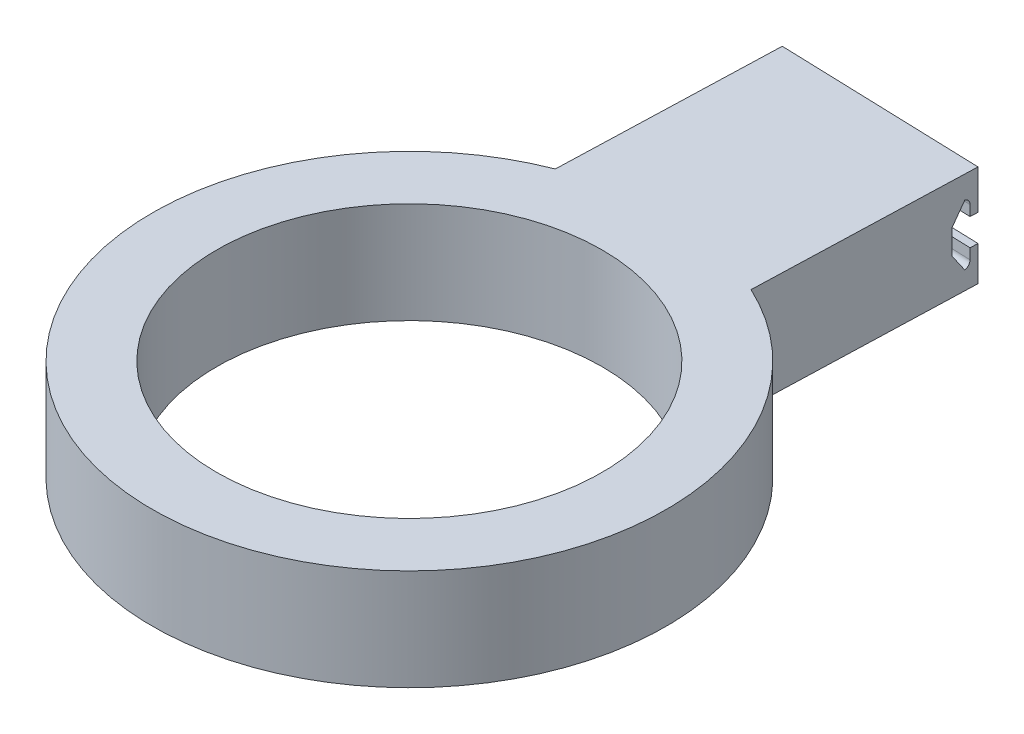
ISO-10303-21;
HEADER;
FILE_DESCRIPTION(('STEP AP214'),'2;1');
FILE_NAME('part.step','',(''),(''),'','','');
FILE_SCHEMA(('AUTOMOTIVE_DESIGN { 1 0 10303 214 1 1 1 1 }'));
ENDSEC;
DATA;
#1=APPLICATION_CONTEXT('core data for automotive mechanical design processes');
#2=APPLICATION_PROTOCOL_DEFINITION('international standard','automotive_design',2000,#1);
#3=PRODUCT_CONTEXT('',#1,'mechanical');
#4=PRODUCT('Part','Part','',(#3));
#5=PRODUCT_RELATED_PRODUCT_CATEGORY('part','',(#4));
#6=PRODUCT_DEFINITION_FORMATION('','',#4);
#7=PRODUCT_DEFINITION_CONTEXT('part definition',#1,'design');
#8=PRODUCT_DEFINITION('design','',#6,#7);
#9=PRODUCT_DEFINITION_SHAPE('','',#8);
#10=(LENGTH_UNIT() NAMED_UNIT(*) SI_UNIT(.MILLI.,.METRE.));
#11=(NAMED_UNIT(*) PLANE_ANGLE_UNIT() SI_UNIT($,.RADIAN.));
#12=(NAMED_UNIT(*) SI_UNIT($,.STERADIAN.) SOLID_ANGLE_UNIT());
#13=UNCERTAINTY_MEASURE_WITH_UNIT(LENGTH_MEASURE(1.E-05),#10,'distance_accuracy_value','');
#14=(GEOMETRIC_REPRESENTATION_CONTEXT(3) GLOBAL_UNCERTAINTY_ASSIGNED_CONTEXT((#13)) GLOBAL_UNIT_ASSIGNED_CONTEXT((#10,
#11,#12)) REPRESENTATION_CONTEXT('',''));
#15=CARTESIAN_POINT('',(0.,0.,0.));
#16=DIRECTION('',(0.,0.,1.));
#17=DIRECTION('',(1.,0.,0.));
#18=AXIS2_PLACEMENT_3D('',#15,#16,#17);
#19=CARTESIAN_POINT('',(2.950089281079,0.,-90.1139316346645));
#20=DIRECTION('',(-0.0327197986339648,0.,0.999464564042844));
#21=DIRECTION('',(0.999464564042844,0.,0.0327197986339648));
#22=AXIS2_PLACEMENT_3D('',#19,#20,#21);
#23=PLANE('',#22);
#24=DIRECTION('',(0.,1.,0.));
#25=VECTOR('',#24,1.);
#26=CARTESIAN_POINT('',(-17.049910718921,0.,-90.7686781821882));
#27=LINE('',#26,#25);
#28=CARTESIAN_POINT('',(-17.049910718921,0.,-90.7686781821882));
#29=VERTEX_POINT('',#28);
#30=CARTESIAN_POINT('',(-17.049910718921,6.88848700330124,-90.7686781821882));
#31=VERTEX_POINT('',#30);
#32=EDGE_CURVE('E203',#29,#31,#27,.T.);
#33=ORIENTED_EDGE('',*,*,#32,.T.);
#34=DIRECTION('',(0.999464564042844,0.,0.0327197986339648));
#35=VECTOR('',#34,1.);
#36=CARTESIAN_POINT('',(2.950089281079,6.88848700330124,-90.1139316346645));
#37=LINE('',#36,#35);
#38=CARTESIAN_POINT('',(22.950089281079,6.88848700330124,-89.4591850871409));
#39=VERTEX_POINT('',#38);
#40=EDGE_CURVE('E141',#31,#39,#37,.T.);
#41=ORIENTED_EDGE('',*,*,#40,.T.);
#42=DIRECTION('',(0.,1.,0.));
#43=VECTOR('',#42,1.);
#44=CARTESIAN_POINT('',(22.950089281079,0.,-89.4591850871409));
#45=LINE('',#44,#43);
#46=CARTESIAN_POINT('',(22.950089281079,0.,-89.4591850871409));
#47=VERTEX_POINT('',#46);
#48=EDGE_CURVE('E206',#47,#39,#45,.T.);
#49=ORIENTED_EDGE('',*,*,#48,.F.);
#50=DIRECTION('',(0.999464564042844,0.,0.0327197986339648));
#51=VECTOR('',#50,1.);
#52=CARTESIAN_POINT('',(2.950089281079,0.,-90.1139316346645));
#53=LINE('',#52,#51);
#54=EDGE_CURVE('E184',#29,#47,#53,.T.);
#55=ORIENTED_EDGE('',*,*,#54,.F.);
#56=EDGE_LOOP('',(#33,#41,#49,#55));
#57=FACE_BOUND('',#56,.T.);
#58=ADVANCED_FACE('F35',(#57),#23,.F.);
#59=CARTESIAN_POINT('',(0.,20.,0.));
#60=DIRECTION('',(0.,1.,0.));
#61=DIRECTION('',(0.,0.,1.));
#62=AXIS2_PLACEMENT_3D('',#59,#60,#61);
#63=PLANE('',#62);
#64=CARTESIAN_POINT('',(0.,20.,0.));
#65=DIRECTION('',(0.,1.,0.));
#66=DIRECTION('',(0.,0.,1.));
#67=AXIS2_PLACEMENT_3D('',#64,#65,#66);
#68=CIRCLE('',#67,50.8);
#69=CARTESIAN_POINT('',(-18.4722231813913,20.,-47.3224784931735));
#70=VERTEX_POINT('',#69);
#71=CARTESIAN_POINT('',(21.5277768186087,20.,-46.0129853981262));
#72=VERTEX_POINT('',#71);
#73=EDGE_CURVE('E215',#70,#72,#68,.T.);
#74=ORIENTED_EDGE('',*,*,#73,.T.);
#75=DIRECTION('',(0.0327197986339645,0.,-0.999464564042844));
#76=VECTOR('',#75,1.);
#77=CARTESIAN_POINT('',(20.,20.,0.654746547523658));
#78=LINE('',#77,#76);
#79=CARTESIAN_POINT('',(22.950089281079,20.,-89.4591850871409));
#80=VERTEX_POINT('',#79);
#81=EDGE_CURVE('E180',#72,#80,#78,.T.);
#82=ORIENTED_EDGE('',*,*,#81,.T.);
#83=DIRECTION('',(0.999464564042844,0.,0.0327197986339648));
#84=VECTOR('',#83,1.);
#85=CARTESIAN_POINT('',(2.950089281079,20.,-90.1139316346645));
#86=LINE('',#85,#84);
#87=CARTESIAN_POINT('',(-17.049910718921,20.,-90.7686781821882));
#88=VERTEX_POINT('',#87);
#89=EDGE_CURVE('E192',#88,#80,#86,.T.);
#90=ORIENTED_EDGE('',*,*,#89,.F.);
#91=DIRECTION('',(0.0327197986339638,0.,-0.999464564042844));
#92=VECTOR('',#91,1.);
#93=CARTESIAN_POINT('',(-20.,20.,-0.654746547523641));
#94=LINE('',#93,#92);
#95=EDGE_CURVE('E185',#70,#88,#94,.T.);
#96=ORIENTED_EDGE('',*,*,#95,.F.);
#97=EDGE_LOOP('',(#74,#82,#90,#96));
#98=FACE_BOUND('',#97,.T.);
#99=CARTESIAN_POINT('',(0.,20.,0.));
#100=DIRECTION('',(0.,1.,0.));
#101=DIRECTION('',(0.,0.,1.));
#102=AXIS2_PLACEMENT_3D('',#99,#100,#101);
#103=CIRCLE('',#102,38.1);
#104=CARTESIAN_POINT('',(0.,20.,38.1));
#105=VERTEX_POINT('',#104);
#106=EDGE_CURVE('E209',#105,#105,#103,.T.);
#107=ORIENTED_EDGE('',*,*,#106,.F.);
#108=EDGE_LOOP('',(#107));
#109=FACE_BOUND('',#108,.T.);
#110=ADVANCED_FACE('F279',(#98,#109),#63,.T.);
#111=CARTESIAN_POINT('',(0.,0.,0.));
#112=DIRECTION('',(0.,1.,0.));
#113=DIRECTION('',(0.,0.,1.));
#114=AXIS2_PLACEMENT_3D('',#111,#112,#113);
#115=PLANE('',#114);
#116=CARTESIAN_POINT('',(0.,0.,0.));
#117=DIRECTION('',(0.,1.,0.));
#118=DIRECTION('',(0.,0.,1.));
#119=AXIS2_PLACEMENT_3D('',#116,#117,#118);
#120=CIRCLE('',#119,50.8);
#121=CARTESIAN_POINT('',(-18.4722231813913,0.,-47.3224784931735));
#122=VERTEX_POINT('',#121);
#123=CARTESIAN_POINT('',(21.5277768186087,0.,-46.0129853981262));
#124=VERTEX_POINT('',#123);
#125=EDGE_CURVE('E212',#122,#124,#120,.T.);
#126=ORIENTED_EDGE('',*,*,#125,.F.);
#127=DIRECTION('',(0.0327197986339638,0.,-0.999464564042844));
#128=VECTOR('',#127,1.);
#129=CARTESIAN_POINT('',(-20.,0.,-0.654746547523641));
#130=LINE('',#129,#128);
#131=EDGE_CURVE('E187',#122,#29,#130,.T.);
#132=ORIENTED_EDGE('',*,*,#131,.T.);
#133=ORIENTED_EDGE('',*,*,#54,.T.);
#134=DIRECTION('',(0.0327197986339645,0.,-0.999464564042844));
#135=VECTOR('',#134,1.);
#136=CARTESIAN_POINT('',(20.,0.,0.654746547523658));
#137=LINE('',#136,#135);
#138=EDGE_CURVE('E181',#124,#47,#137,.T.);
#139=ORIENTED_EDGE('',*,*,#138,.F.);
#140=EDGE_LOOP('',(#126,#132,#133,#139));
#141=FACE_BOUND('',#140,.T.);
#142=CARTESIAN_POINT('',(0.,0.,0.));
#143=DIRECTION('',(0.,1.,0.));
#144=DIRECTION('',(0.,0.,1.));
#145=AXIS2_PLACEMENT_3D('',#142,#143,#144);
#146=CIRCLE('',#145,38.1);
#147=CARTESIAN_POINT('',(0.,0.,38.1));
#148=VERTEX_POINT('',#147);
#149=EDGE_CURVE('E199',#148,#148,#146,.T.);
#150=ORIENTED_EDGE('',*,*,#149,.T.);
#151=EDGE_LOOP('',(#150));
#152=FACE_BOUND('',#151,.T.);
#153=ADVANCED_FACE('F286',(#141,#152),#115,.F.);
#154=CARTESIAN_POINT('',(0.,20.,0.));
#155=DIRECTION('',(0.,-1.,0.));
#156=DIRECTION('',(0.,0.,-1.));
#157=AXIS2_PLACEMENT_3D('',#154,#155,#156);
#158=CYLINDRICAL_SURFACE('',#157,50.8);
#159=ORIENTED_EDGE('',*,*,#125,.T.);
#160=DIRECTION('',(0.,1.,0.));
#161=VECTOR('',#160,1.);
#162=CARTESIAN_POINT('',(21.5277768186087,0.,-46.0129853981262));
#163=LINE('',#162,#161);
#164=EDGE_CURVE('E196',#124,#72,#163,.T.);
#165=ORIENTED_EDGE('',*,*,#164,.T.);
#166=ORIENTED_EDGE('',*,*,#73,.F.);
#167=DIRECTION('',(0.,1.,0.));
#168=VECTOR('',#167,1.);
#169=CARTESIAN_POINT('',(-18.4722231813913,0.,-47.3224784931735));
#170=LINE('',#169,#168);
#171=EDGE_CURVE('E200',#122,#70,#170,.T.);
#172=ORIENTED_EDGE('',*,*,#171,.F.);
#173=EDGE_LOOP('',(#159,#165,#166,#172));
#174=FACE_BOUND('',#173,.T.);
#175=ADVANCED_FACE('F303',(#174),#158,.T.);
#176=CARTESIAN_POINT('',(0.,20.,0.));
#177=DIRECTION('',(0.,-1.,0.));
#178=DIRECTION('',(0.,0.,-1.));
#179=AXIS2_PLACEMENT_3D('',#176,#177,#178);
#180=CYLINDRICAL_SURFACE('',#179,38.1);
#181=ORIENTED_EDGE('',*,*,#106,.T.);
#182=EDGE_LOOP('',(#181));
#183=FACE_BOUND('',#182,.T.);
#184=ORIENTED_EDGE('',*,*,#149,.F.);
#185=EDGE_LOOP('',(#184));
#186=FACE_BOUND('',#185,.T.);
#187=ADVANCED_FACE('F364',(#183,#186),#180,.F.);
#188=CARTESIAN_POINT('',(20.,0.,0.654746547523658));
#189=DIRECTION('',(0.999464564042844,0.,0.0327197986339645));
#190=DIRECTION('',(0.0327197986339645,0.,-0.999464564042844));
#191=AXIS2_PLACEMENT_3D('',#188,#189,#190);
#192=PLANE('',#191);
#193=DIRECTION('',(0.0327197986339645,0.,-0.999464564042844));
#194=VECTOR('',#193,1.);
#195=CARTESIAN_POINT('',(20.,6.88848700330124,0.654746547523658));
#196=LINE('',#195,#194);
#197=CARTESIAN_POINT('',(22.9002243079608,6.88848700330124,-87.9360010915396));
#198=VERTEX_POINT('',#197);
#199=EDGE_CURVE('E167',#198,#39,#196,.T.);
#200=ORIENTED_EDGE('',*,*,#199,.F.);
#201=DIRECTION('',(0.,1.,0.));
#202=VECTOR('',#201,1.);
#203=CARTESIAN_POINT('',(22.9002243079608,0.,-87.9360010915396));
#204=LINE('',#203,#202);
#205=CARTESIAN_POINT('',(22.9002243079608,4.83082779263509,-87.9360010915396));
#206=VERTEX_POINT('',#205);
#207=EDGE_CURVE('E178',#206,#198,#204,.T.);
#208=ORIENTED_EDGE('',*,*,#207,.F.);
#209=CARTESIAN_POINT('',(22.8586701636957,4.83082779263509,-86.6666810952051));
#210=DIRECTION('',(0.999464564042844,0.,0.0327197986339645));
#211=DIRECTION('',(0.0327197986339645,0.,-0.999464564042844));
#212=AXIS2_PLACEMENT_3D('',#209,#210,#211);
#213=CIRCLE('',#212,1.27);
#214=CARTESIAN_POINT('',(22.8669809925487,3.58648700330124,-86.920545094472));
#215=VERTEX_POINT('',#214);
#216=EDGE_CURVE('E237',#206,#215,#213,.F.);
#217=ORIENTED_EDGE('',*,*,#216,.T.);
#218=DIRECTION('',(0.0185610771174099,-0.823529411764706,-0.566969835506898));
#219=VECTOR('',#218,1.);
#220=CARTESIAN_POINT('',(21.9992100735626,42.0882867608637,-60.4134662173649));
#221=LINE('',#220,#219);
#222=CARTESIAN_POINT('',(22.7868342615558,7.14248700330124,-84.4723693447532));
#223=VERTEX_POINT('',#222);
#224=EDGE_CURVE('E175',#223,#215,#221,.T.);
#225=ORIENTED_EDGE('',*,*,#224,.F.);
#226=DIRECTION('',(0.,-1.,0.));
#227=VECTOR('',#226,1.);
#228=CARTESIAN_POINT('',(22.7868342615558,0.,-84.4723693447533));
#229=LINE('',#228,#227);
#230=CARTESIAN_POINT('',(22.7868342615557,11.9684870033012,-84.4723693447533));
#231=VERTEX_POINT('',#230);
#232=EDGE_CURVE('E173',#231,#223,#229,.T.);
#233=ORIENTED_EDGE('',*,*,#232,.F.);
#234=DIRECTION('',(-0.0185610771174099,-0.823529411764706,0.566969835506898));
#235=VECTOR('',#234,1.);
#236=CARTESIAN_POINT('',(21.7070875045887,-35.9383885511266,-51.4902402735649));
#237=LINE('',#236,#235);
#238=CARTESIAN_POINT('',(22.8669809925487,15.5244870033012,-86.920545094472));
#239=VERTEX_POINT('',#238);
#240=EDGE_CURVE('E171',#239,#231,#237,.T.);
#241=ORIENTED_EDGE('',*,*,#240,.F.);
#242=CARTESIAN_POINT('',(22.8586701636957,14.2801462139674,-86.6666810952051));
#243=DIRECTION('',(0.999464564042844,0.,0.0327197986339645));
#244=DIRECTION('',(0.0327197986339645,0.,-0.999464564042844));
#245=AXIS2_PLACEMENT_3D('',#242,#243,#244);
#246=CIRCLE('',#245,1.27);
#247=CARTESIAN_POINT('',(22.9002243079608,14.2801462139674,-87.9360010915396));
#248=VERTEX_POINT('',#247);
#249=EDGE_CURVE('E43',#239,#248,#246,.F.);
#250=ORIENTED_EDGE('',*,*,#249,.T.);
#251=DIRECTION('',(0.,1.,0.));
#252=VECTOR('',#251,1.);
#253=CARTESIAN_POINT('',(22.9002243079608,0.,-87.9360010915396));
#254=LINE('',#253,#252);
#255=CARTESIAN_POINT('',(22.9002243079608,12.2224870033012,-87.9360010915396));
#256=VERTEX_POINT('',#255);
#257=EDGE_CURVE('E169',#256,#248,#254,.T.);
#258=ORIENTED_EDGE('',*,*,#257,.F.);
#259=DIRECTION('',(-0.0327197986339645,0.,0.999464564042844));
#260=VECTOR('',#259,1.);
#261=CARTESIAN_POINT('',(20.,12.2224870033012,0.654746547523658));
#262=LINE('',#261,#260);
#263=CARTESIAN_POINT('',(22.950089281079,12.2224870033012,-89.4591850871409));
#264=VERTEX_POINT('',#263);
#265=EDGE_CURVE('E148',#264,#256,#262,.T.);
#266=ORIENTED_EDGE('',*,*,#265,.F.);
#267=EDGE_CURVE('E189',#264,#80,#45,.T.);
#268=ORIENTED_EDGE('',*,*,#267,.T.);
#269=ORIENTED_EDGE('',*,*,#81,.F.);
#270=ORIENTED_EDGE('',*,*,#164,.F.);
#271=ORIENTED_EDGE('',*,*,#138,.T.);
#272=ORIENTED_EDGE('',*,*,#48,.T.);
#273=EDGE_LOOP('',(#200,#208,#217,#225,#233,#241,#250,#258,#266,#268,#269,#270,#271,#272));
#274=FACE_BOUND('',#273,.T.);
#275=ADVANCED_FACE('F253',(#274),#192,.T.);
#276=CARTESIAN_POINT('',(-20.,0.,-0.654746547523641));
#277=DIRECTION('',(0.999464564042844,0.,0.0327197986339638));
#278=DIRECTION('',(0.0327197986339638,0.,-0.999464564042844));
#279=AXIS2_PLACEMENT_3D('',#276,#277,#278);
#280=PLANE('',#279);
#281=DIRECTION('',(0.0185610771174094,-0.823529411764706,-0.566969835506898));
#282=VECTOR('',#281,1.);
#283=CARTESIAN_POINT('',(-18.0007899264375,42.0882867608637,-61.7229593124122));
#284=LINE('',#283,#282);
#285=CARTESIAN_POINT('',(-17.2131657384443,7.14248700330124,-85.7818624398006));
#286=VERTEX_POINT('',#285);
#287=CARTESIAN_POINT('',(-17.1330190074513,3.58648700330124,-88.2300381895193));
#288=VERTEX_POINT('',#287);
#289=EDGE_CURVE('E229',#286,#288,#284,.T.);
#290=ORIENTED_EDGE('',*,*,#289,.T.);
#291=CARTESIAN_POINT('',(-17.1413298363044,4.83082779263509,-87.9761741902525));
#292=DIRECTION('',(0.999464564042844,0.,0.0327197986339638));
#293=DIRECTION('',(0.0327197986339638,0.,-0.999464564042844));
#294=AXIS2_PLACEMENT_3D('',#291,#292,#293);
#295=CIRCLE('',#294,1.27);
#296=CARTESIAN_POINT('',(-17.0997756920392,4.83082779263509,-89.2454941865869));
#297=VERTEX_POINT('',#296);
#298=EDGE_CURVE('E239',#288,#297,#295,.T.);
#299=ORIENTED_EDGE('',*,*,#298,.T.);
#300=DIRECTION('',(0.,1.,0.));
#301=VECTOR('',#300,1.);
#302=CARTESIAN_POINT('',(-17.0997756920392,0.,-89.2454941865869));
#303=LINE('',#302,#301);
#304=CARTESIAN_POINT('',(-17.0997756920392,6.88848700330124,-89.2454941865869));
#305=VERTEX_POINT('',#304);
#306=EDGE_CURVE('E231',#297,#305,#303,.T.);
#307=ORIENTED_EDGE('',*,*,#306,.T.);
#308=DIRECTION('',(0.0327197986339638,0.,-0.999464564042844));
#309=VECTOR('',#308,1.);
#310=CARTESIAN_POINT('',(-20.,6.88848700330124,-0.654746547523641));
#311=LINE('',#310,#309);
#312=EDGE_CURVE('E158',#305,#31,#311,.T.);
#313=ORIENTED_EDGE('',*,*,#312,.T.);
#314=ORIENTED_EDGE('',*,*,#32,.F.);
#315=ORIENTED_EDGE('',*,*,#131,.F.);
#316=ORIENTED_EDGE('',*,*,#171,.T.);
#317=ORIENTED_EDGE('',*,*,#95,.T.);
#318=CARTESIAN_POINT('',(-17.049910718921,12.2224870033012,-90.7686781821882));
#319=VERTEX_POINT('',#318);
#320=EDGE_CURVE('E155',#319,#88,#27,.T.);
#321=ORIENTED_EDGE('',*,*,#320,.F.);
#322=DIRECTION('',(-0.0327197986339638,0.,0.999464564042844));
#323=VECTOR('',#322,1.);
#324=CARTESIAN_POINT('',(-20.,12.2224870033012,-0.654746547523641));
#325=LINE('',#324,#323);
#326=CARTESIAN_POINT('',(-17.0997756920392,12.2224870033012,-89.2454941865869));
#327=VERTEX_POINT('',#326);
#328=EDGE_CURVE('E145',#319,#327,#325,.T.);
#329=ORIENTED_EDGE('',*,*,#328,.T.);
#330=DIRECTION('',(0.,1.,0.));
#331=VECTOR('',#330,1.);
#332=CARTESIAN_POINT('',(-17.0997756920392,0.,-89.2454941865869));
#333=LINE('',#332,#331);
#334=CARTESIAN_POINT('',(-17.0997756920392,14.2801462139674,-89.2454941865869));
#335=VERTEX_POINT('',#334);
#336=EDGE_CURVE('E133',#327,#335,#333,.T.);
#337=ORIENTED_EDGE('',*,*,#336,.T.);
#338=CARTESIAN_POINT('',(-17.1413298363043,14.2801462139674,-87.9761741902525));
#339=DIRECTION('',(0.999464564042844,0.,0.0327197986339638));
#340=DIRECTION('',(0.0327197986339638,0.,-0.999464564042844));
#341=AXIS2_PLACEMENT_3D('',#338,#339,#340);
#342=CIRCLE('',#341,1.27);
#343=CARTESIAN_POINT('',(-17.1330190074513,15.5244870033012,-88.2300381895193));
#344=VERTEX_POINT('',#343);
#345=EDGE_CURVE('E11',#335,#344,#342,.T.);
#346=ORIENTED_EDGE('',*,*,#345,.T.);
#347=DIRECTION('',(-0.0185610771174095,-0.823529411764706,0.566969835506898));
#348=VECTOR('',#347,1.);
#349=CARTESIAN_POINT('',(-18.2929124954113,-35.9383885511266,-52.7997333686122));
#350=LINE('',#349,#348);
#351=CARTESIAN_POINT('',(-17.2131657384443,11.9684870033013,-85.7818624398006));
#352=VERTEX_POINT('',#351);
#353=EDGE_CURVE('E140',#344,#352,#350,.T.);
#354=ORIENTED_EDGE('',*,*,#353,.T.);
#355=DIRECTION('',(0.,-1.,0.));
#356=VECTOR('',#355,1.);
#357=CARTESIAN_POINT('',(-17.2131657384443,0.,-85.7818624398006));
#358=LINE('',#357,#356);
#359=EDGE_CURVE('E226',#352,#286,#358,.T.);
#360=ORIENTED_EDGE('',*,*,#359,.T.);
#361=EDGE_LOOP('',(#290,#299,#307,#313,#314,#315,#316,#317,#321,#329,#337,#346,#354,#360));
#362=FACE_BOUND('',#361,.T.);
#363=ADVANCED_FACE('F153',(#362),#280,.F.);
#364=ORIENTED_EDGE('',*,*,#267,.F.);
#365=DIRECTION('',(-0.999464564042844,0.,-0.0327197986339648));
#366=VECTOR('',#365,1.);
#367=CARTESIAN_POINT('',(2.950089281079,12.2224870033012,-90.1139316346645));
#368=LINE('',#367,#366);
#369=EDGE_CURVE('E218',#264,#319,#368,.T.);
#370=ORIENTED_EDGE('',*,*,#369,.T.);
#371=ORIENTED_EDGE('',*,*,#320,.T.);
#372=ORIENTED_EDGE('',*,*,#89,.T.);
#373=EDGE_LOOP('',(#364,#370,#371,#372));
#374=FACE_BOUND('',#373,.T.);
#375=ADVANCED_FACE('F282',(#374),#23,.F.);
#376=CARTESIAN_POINT('',(-50.8137326262708,3.58648700330124,-90.3491990318893));
#377=DIRECTION('',(0.0327197986339645,0.,-0.999464564042844));
#378=DIRECTION('',(-0.999464564042844,0.,-0.0327197986339645));
#379=AXIS2_PLACEMENT_3D('',#376,#377,#378);
#380=PLANE('',#379);
#381=ORIENTED_EDGE('',*,*,#306,.F.);
#382=DIRECTION('',(-0.999464564042844,0.,-0.0327197986339645));
#383=VECTOR('',#382,1.);
#384=CARTESIAN_POINT('',(-50.8137326262708,4.83082779263509,-90.3491990318893));
#385=LINE('',#384,#383);
#386=EDGE_CURVE('E233',#297,#206,#385,.F.);
#387=ORIENTED_EDGE('',*,*,#386,.T.);
#388=ORIENTED_EDGE('',*,*,#207,.T.);
#389=DIRECTION('',(0.999464564042844,0.,0.0327197986339645));
#390=VECTOR('',#389,1.);
#391=CARTESIAN_POINT('',(-50.8137326262708,6.88848700330124,-90.3491990318893));
#392=LINE('',#391,#390);
#393=EDGE_CURVE('E156',#305,#198,#392,.T.);
#394=ORIENTED_EDGE('',*,*,#393,.F.);
#395=EDGE_LOOP('',(#381,#387,#388,#394));
#396=FACE_BOUND('',#395,.T.);
#397=ADVANCED_FACE('F248',(#396),#380,.F.);
#398=CARTESIAN_POINT('',(-50.9271226726759,7.14248700330124,-86.885567285103));
#399=DIRECTION('',(-0.0269457165220884,-0.567273574176056,0.823088464505872));
#400=DIRECTION('',(0.,-0.823387437918,-0.56747962701654));
#401=AXIS2_PLACEMENT_3D('',#398,#399,#400);
#402=PLANE('',#401);
#403=ORIENTED_EDGE('',*,*,#224,.T.);
#404=DIRECTION('',(0.999464564042844,0.,0.0327197986339645));
#405=VECTOR('',#404,1.);
#406=CARTESIAN_POINT('',(-50.8469759416829,3.58648700330124,-89.3337430348218));
#407=LINE('',#406,#405);
#408=EDGE_CURVE('E161',#288,#215,#407,.T.);
#409=ORIENTED_EDGE('',*,*,#408,.F.);
#410=ORIENTED_EDGE('',*,*,#289,.F.);
#411=DIRECTION('',(0.999464564042844,0.,0.0327197986339645));
#412=VECTOR('',#411,1.);
#413=CARTESIAN_POINT('',(-50.9271226726759,7.14248700330124,-86.885567285103));
#414=LINE('',#413,#412);
#415=EDGE_CURVE('E259',#286,#223,#414,.T.);
#416=ORIENTED_EDGE('',*,*,#415,.T.);
#417=EDGE_LOOP('',(#403,#409,#410,#416));
#418=FACE_BOUND('',#417,.T.);
#419=ADVANCED_FACE('F257',(#418),#402,.F.);
#420=CARTESIAN_POINT('',(-50.9271226726759,11.9684870033012,-86.885567285103));
#421=DIRECTION('',(-0.0327197986339645,0.,0.999464564042844));
#422=DIRECTION('',(0.999464564042844,0.,0.0327197986339645));
#423=AXIS2_PLACEMENT_3D('',#420,#421,#422);
#424=PLANE('',#423);
#425=ORIENTED_EDGE('',*,*,#232,.T.);
#426=ORIENTED_EDGE('',*,*,#415,.F.);
#427=ORIENTED_EDGE('',*,*,#359,.F.);
#428=DIRECTION('',(0.999464564042844,0.,0.0327197986339645));
#429=VECTOR('',#428,1.);
#430=CARTESIAN_POINT('',(-50.9271226726759,11.9684870033012,-86.885567285103));
#431=LINE('',#430,#429);
#432=EDGE_CURVE('E261',#352,#231,#431,.T.);
#433=ORIENTED_EDGE('',*,*,#432,.T.);
#434=EDGE_LOOP('',(#425,#426,#427,#433));
#435=FACE_BOUND('',#434,.T.);
#436=ADVANCED_FACE('F273',(#435),#424,.F.);
#437=CARTESIAN_POINT('',(-50.8469759416829,15.5244870033012,-89.3337430348218));
#438=DIRECTION('',(-0.0269457165220884,0.567273574176056,0.823088464505872));
#439=DIRECTION('',(0.,-0.823387437918,0.567479627016541));
#440=AXIS2_PLACEMENT_3D('',#437,#438,#439);
#441=PLANE('',#440);
#442=ORIENTED_EDGE('',*,*,#240,.T.);
#443=ORIENTED_EDGE('',*,*,#432,.F.);
#444=ORIENTED_EDGE('',*,*,#353,.F.);
#445=DIRECTION('',(0.999464564042844,0.,0.0327197986339645));
#446=VECTOR('',#445,1.);
#447=CARTESIAN_POINT('',(-50.8469759416829,15.5244870033012,-89.3337430348218));
#448=LINE('',#447,#446);
#449=EDGE_CURVE('E149',#344,#239,#448,.T.);
#450=ORIENTED_EDGE('',*,*,#449,.T.);
#451=EDGE_LOOP('',(#442,#443,#444,#450));
#452=FACE_BOUND('',#451,.T.);
#453=ADVANCED_FACE('F270',(#452),#441,.F.);
#454=CARTESIAN_POINT('',(-50.8137326262708,12.2224870033012,-90.3491990318893));
#455=DIRECTION('',(0.0327197986339645,0.,-0.999464564042844));
#456=DIRECTION('',(-0.999464564042844,0.,-0.0327197986339645));
#457=AXIS2_PLACEMENT_3D('',#454,#455,#456);
#458=PLANE('',#457);
#459=ORIENTED_EDGE('',*,*,#257,.T.);
#460=DIRECTION('',(0.999464564042844,0.,0.0327197986339645));
#461=VECTOR('',#460,1.);
#462=CARTESIAN_POINT('',(-50.8137326262708,14.2801462139674,-90.3491990318893));
#463=LINE('',#462,#461);
#464=EDGE_CURVE('E50',#248,#335,#463,.F.);
#465=ORIENTED_EDGE('',*,*,#464,.T.);
#466=ORIENTED_EDGE('',*,*,#336,.F.);
#467=DIRECTION('',(0.999464564042844,0.,0.0327197986339645));
#468=VECTOR('',#467,1.);
#469=CARTESIAN_POINT('',(-50.8137326262708,12.2224870033012,-90.3491990318893));
#470=LINE('',#469,#468);
#471=EDGE_CURVE('E136',#327,#256,#470,.T.);
#472=ORIENTED_EDGE('',*,*,#471,.T.);
#473=EDGE_LOOP('',(#459,#465,#466,#472));
#474=FACE_BOUND('',#473,.T.);
#475=ADVANCED_FACE('F135',(#474),#458,.F.);
#476=CARTESIAN_POINT('',(-50.8137326262708,6.88848700330124,-90.3491990318893));
#477=DIRECTION('',(0.,-1.,0.));
#478=DIRECTION('',(0.,0.,-1.));
#479=AXIS2_PLACEMENT_3D('',#476,#477,#478);
#480=PLANE('',#479);
#481=ORIENTED_EDGE('',*,*,#199,.T.);
#482=ORIENTED_EDGE('',*,*,#40,.F.);
#483=ORIENTED_EDGE('',*,*,#312,.F.);
#484=ORIENTED_EDGE('',*,*,#393,.T.);
#485=EDGE_LOOP('',(#481,#482,#483,#484));
#486=FACE_BOUND('',#485,.T.);
#487=ADVANCED_FACE('F313',(#486),#480,.F.);
#488=CARTESIAN_POINT('',(-50.7638676531526,12.2224870033012,-91.8723830274906));
#489=DIRECTION('',(0.,1.,0.));
#490=DIRECTION('',(0.,0.,1.));
#491=AXIS2_PLACEMENT_3D('',#488,#489,#490);
#492=PLANE('',#491);
#493=ORIENTED_EDGE('',*,*,#265,.T.);
#494=ORIENTED_EDGE('',*,*,#471,.F.);
#495=ORIENTED_EDGE('',*,*,#328,.F.);
#496=ORIENTED_EDGE('',*,*,#369,.F.);
#497=EDGE_LOOP('',(#493,#494,#495,#496));
#498=FACE_BOUND('',#497,.T.);
#499=ADVANCED_FACE('F144',(#498),#492,.F.);
#500=CARTESIAN_POINT('',(-50.8552867705359,4.83082779263509,-89.0798790355549));
#501=DIRECTION('',(-0.999464564042844,0.,-0.0327197986339645));
#502=DIRECTION('',(-0.0327197986339645,0.,0.999464564042844));
#503=AXIS2_PLACEMENT_3D('',#500,#501,#502);
#504=CYLINDRICAL_SURFACE('',#503,1.27);
#505=ORIENTED_EDGE('',*,*,#298,.F.);
#506=ORIENTED_EDGE('',*,*,#408,.T.);
#507=ORIENTED_EDGE('',*,*,#216,.F.);
#508=ORIENTED_EDGE('',*,*,#386,.F.);
#509=EDGE_LOOP('',(#505,#506,#507,#508));
#510=FACE_BOUND('',#509,.T.);
#511=ADVANCED_FACE('F250',(#510),#504,.F.);
#512=CARTESIAN_POINT('',(-50.8552867705359,14.2801462139674,-89.0798790355549));
#513=DIRECTION('',(0.999464564042844,0.,0.0327197986339645));
#514=DIRECTION('',(0.0327197986339645,0.,-0.999464564042844));
#515=AXIS2_PLACEMENT_3D('',#512,#513,#514);
#516=CYLINDRICAL_SURFACE('',#515,1.27);
#517=ORIENTED_EDGE('',*,*,#345,.F.);
#518=ORIENTED_EDGE('',*,*,#464,.F.);
#519=ORIENTED_EDGE('',*,*,#249,.F.);
#520=ORIENTED_EDGE('',*,*,#449,.F.);
#521=EDGE_LOOP('',(#517,#518,#519,#520));
#522=FACE_BOUND('',#521,.T.);
#523=ADVANCED_FACE('F37',(#522),#516,.F.);
#524=CLOSED_SHELL('',(#58,#110,#153,#175,#187,#275,#363,#375,#397,#419,#436,#453,#475,#487,#499,
#511,#523));
#525=MANIFOLD_SOLID_BREP('B2',#524);
#526=ADVANCED_BREP_SHAPE_REPRESENTATION('',(#18,#525),#14);
#527=SHAPE_DEFINITION_REPRESENTATION(#9,#526);
ENDSEC;
END-ISO-10303-21;
